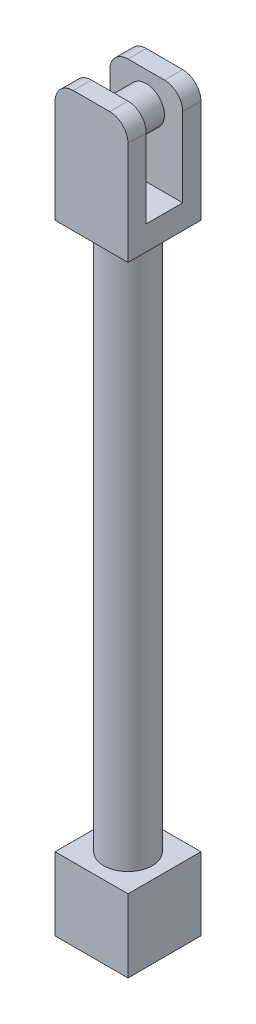
ISO-10303-21;
HEADER;
FILE_DESCRIPTION(('STEP AP214'),'2;1');
FILE_NAME('part.step','',(''),(''),'','','');
FILE_SCHEMA(('AUTOMOTIVE_DESIGN { 1 0 10303 214 1 1 1 1 }'));
ENDSEC;
DATA;
#1=APPLICATION_CONTEXT('core data for automotive mechanical design processes');
#2=APPLICATION_PROTOCOL_DEFINITION('international standard','automotive_design',2000,#1);
#3=PRODUCT_CONTEXT('',#1,'mechanical');
#4=PRODUCT('Part','Part','',(#3));
#5=PRODUCT_RELATED_PRODUCT_CATEGORY('part','',(#4));
#6=PRODUCT_DEFINITION_FORMATION('','',#4);
#7=PRODUCT_DEFINITION_CONTEXT('part definition',#1,'design');
#8=PRODUCT_DEFINITION('design','',#6,#7);
#9=PRODUCT_DEFINITION_SHAPE('','',#8);
#10=(LENGTH_UNIT() NAMED_UNIT(*) SI_UNIT(.MILLI.,.METRE.));
#11=(NAMED_UNIT(*) PLANE_ANGLE_UNIT() SI_UNIT($,.RADIAN.));
#12=(NAMED_UNIT(*) SI_UNIT($,.STERADIAN.) SOLID_ANGLE_UNIT());
#13=UNCERTAINTY_MEASURE_WITH_UNIT(LENGTH_MEASURE(1.E-05),#10,'distance_accuracy_value','');
#14=(GEOMETRIC_REPRESENTATION_CONTEXT(3) GLOBAL_UNCERTAINTY_ASSIGNED_CONTEXT((#13)) GLOBAL_UNIT_ASSIGNED_CONTEXT((#10,
#11,#12)) REPRESENTATION_CONTEXT('',''));
#15=CARTESIAN_POINT('',(0.,0.,0.));
#16=DIRECTION('',(0.,0.,1.));
#17=DIRECTION('',(1.,0.,0.));
#18=AXIS2_PLACEMENT_3D('',#15,#16,#17);
#19=CARTESIAN_POINT('',(0.,305.,0.));
#20=DIRECTION('',(0.,1.,0.));
#21=DIRECTION('',(0.,0.,1.));
#22=AXIS2_PLACEMENT_3D('',#19,#20,#21);
#23=PLANE('',#22);
#24=DIRECTION('',(-1.,0.,0.));
#25=VECTOR('',#24,1.);
#26=CARTESIAN_POINT('',(-15.,305.,-7.5));
#27=LINE('',#26,#25);
#28=CARTESIAN_POINT('',(7.5,305.,-7.5));
#29=VERTEX_POINT('',#28);
#30=CARTESIAN_POINT('',(-7.5,305.,-7.5));
#31=VERTEX_POINT('',#30);
#32=EDGE_CURVE('E172',#29,#31,#27,.T.);
#33=ORIENTED_EDGE('',*,*,#32,.F.);
#34=DIRECTION('',(0.,0.,-1.));
#35=VECTOR('',#34,1.);
#36=CARTESIAN_POINT('',(7.5,305.,-15.));
#37=LINE('',#36,#35);
#38=CARTESIAN_POINT('',(7.5,305.,-15.));
#39=VERTEX_POINT('',#38);
#40=EDGE_CURVE('E283',#29,#39,#37,.T.);
#41=ORIENTED_EDGE('',*,*,#40,.T.);
#42=DIRECTION('',(-1.,0.,0.));
#43=VECTOR('',#42,1.);
#44=CARTESIAN_POINT('',(-15.,305.,-15.));
#45=LINE('',#44,#43);
#46=CARTESIAN_POINT('',(-7.5,305.,-15.));
#47=VERTEX_POINT('',#46);
#48=EDGE_CURVE('E184',#39,#47,#45,.T.);
#49=ORIENTED_EDGE('',*,*,#48,.T.);
#50=DIRECTION('',(0.,0.,1.));
#51=VECTOR('',#50,1.);
#52=CARTESIAN_POINT('',(-7.5,305.,-7.5));
#53=LINE('',#52,#51);
#54=EDGE_CURVE('E279',#47,#31,#53,.T.);
#55=ORIENTED_EDGE('',*,*,#54,.T.);
#56=EDGE_LOOP('',(#33,#41,#49,#55));
#57=FACE_BOUND('',#56,.T.);
#58=ADVANCED_FACE('F39',(#57),#23,.T.);
#59=CARTESIAN_POINT('',(15.,30.,-15.));
#60=DIRECTION('',(-1.,0.,0.));
#61=DIRECTION('',(0.,0.,1.));
#62=AXIS2_PLACEMENT_3D('',#59,#60,#61);
#63=PLANE('',#62);
#64=DIRECTION('',(0.,0.,-1.));
#65=VECTOR('',#64,1.);
#66=CARTESIAN_POINT('',(15.,0.,-15.));
#67=LINE('',#66,#65);
#68=CARTESIAN_POINT('',(15.,0.,15.));
#69=VERTEX_POINT('',#68);
#70=CARTESIAN_POINT('',(15.,0.,-15.));
#71=VERTEX_POINT('',#70);
#72=EDGE_CURVE('E225',#69,#71,#67,.T.);
#73=ORIENTED_EDGE('',*,*,#72,.T.);
#74=DIRECTION('',(0.,-1.,0.));
#75=VECTOR('',#74,1.);
#76=CARTESIAN_POINT('',(15.,30.,-15.));
#77=LINE('',#76,#75);
#78=CARTESIAN_POINT('',(15.,30.,-15.));
#79=VERTEX_POINT('',#78);
#80=EDGE_CURVE('E231',#79,#71,#77,.T.);
#81=ORIENTED_EDGE('',*,*,#80,.F.);
#82=DIRECTION('',(0.,0.,-1.));
#83=VECTOR('',#82,1.);
#84=CARTESIAN_POINT('',(15.,30.,-15.));
#85=LINE('',#84,#83);
#86=CARTESIAN_POINT('',(15.,30.,15.));
#87=VERTEX_POINT('',#86);
#88=EDGE_CURVE('E232',#87,#79,#85,.T.);
#89=ORIENTED_EDGE('',*,*,#88,.F.);
#90=DIRECTION('',(0.,-1.,0.));
#91=VECTOR('',#90,1.);
#92=CARTESIAN_POINT('',(15.,30.,15.));
#93=LINE('',#92,#91);
#94=EDGE_CURVE('E246',#87,#69,#93,.T.);
#95=ORIENTED_EDGE('',*,*,#94,.T.);
#96=EDGE_LOOP('',(#73,#81,#89,#95));
#97=FACE_BOUND('',#96,.T.);
#98=ADVANCED_FACE('F386',(#97),#63,.F.);
#99=CARTESIAN_POINT('',(-15.,30.,-15.));
#100=DIRECTION('',(0.,0.,1.));
#101=DIRECTION('',(1.,0.,0.));
#102=AXIS2_PLACEMENT_3D('',#99,#100,#101);
#103=PLANE('',#102);
#104=DIRECTION('',(-1.,0.,0.));
#105=VECTOR('',#104,1.);
#106=CARTESIAN_POINT('',(-15.,0.,-15.));
#107=LINE('',#106,#105);
#108=CARTESIAN_POINT('',(-15.,0.,-15.));
#109=VERTEX_POINT('',#108);
#110=EDGE_CURVE('E250',#71,#109,#107,.T.);
#111=ORIENTED_EDGE('',*,*,#110,.T.);
#112=DIRECTION('',(0.,-1.,0.));
#113=VECTOR('',#112,1.);
#114=CARTESIAN_POINT('',(-15.,30.,-15.));
#115=LINE('',#114,#113);
#116=CARTESIAN_POINT('',(-15.,30.,-15.));
#117=VERTEX_POINT('',#116);
#118=EDGE_CURVE('E265',#117,#109,#115,.T.);
#119=ORIENTED_EDGE('',*,*,#118,.F.);
#120=DIRECTION('',(-1.,0.,0.));
#121=VECTOR('',#120,1.);
#122=CARTESIAN_POINT('',(-15.,30.,-15.));
#123=LINE('',#122,#121);
#124=EDGE_CURVE('E236',#79,#117,#123,.T.);
#125=ORIENTED_EDGE('',*,*,#124,.F.);
#126=ORIENTED_EDGE('',*,*,#80,.T.);
#127=EDGE_LOOP('',(#111,#119,#125,#126));
#128=FACE_BOUND('',#127,.T.);
#129=ADVANCED_FACE('F390',(#128),#103,.F.);
#130=CARTESIAN_POINT('',(-15.,30.,-15.));
#131=DIRECTION('',(1.,0.,0.));
#132=DIRECTION('',(0.,0.,-1.));
#133=AXIS2_PLACEMENT_3D('',#130,#131,#132);
#134=PLANE('',#133);
#135=DIRECTION('',(0.,0.,1.));
#136=VECTOR('',#135,1.);
#137=CARTESIAN_POINT('',(-15.,0.,-15.));
#138=LINE('',#137,#136);
#139=CARTESIAN_POINT('',(-15.,0.,15.));
#140=VERTEX_POINT('',#139);
#141=EDGE_CURVE('E253',#109,#140,#138,.T.);
#142=ORIENTED_EDGE('',*,*,#141,.T.);
#143=DIRECTION('',(0.,-1.,0.));
#144=VECTOR('',#143,1.);
#145=CARTESIAN_POINT('',(-15.,30.,15.));
#146=LINE('',#145,#144);
#147=CARTESIAN_POINT('',(-15.,30.,15.));
#148=VERTEX_POINT('',#147);
#149=EDGE_CURVE('E261',#148,#140,#146,.T.);
#150=ORIENTED_EDGE('',*,*,#149,.F.);
#151=DIRECTION('',(0.,0.,1.));
#152=VECTOR('',#151,1.);
#153=CARTESIAN_POINT('',(-15.,30.,-15.));
#154=LINE('',#153,#152);
#155=EDGE_CURVE('E240',#117,#148,#154,.T.);
#156=ORIENTED_EDGE('',*,*,#155,.F.);
#157=ORIENTED_EDGE('',*,*,#118,.T.);
#158=EDGE_LOOP('',(#142,#150,#156,#157));
#159=FACE_BOUND('',#158,.T.);
#160=ADVANCED_FACE('F426',(#159),#134,.F.);
#161=CARTESIAN_POINT('',(-15.,30.,15.));
#162=DIRECTION('',(0.,0.,-1.));
#163=DIRECTION('',(-1.,0.,0.));
#164=AXIS2_PLACEMENT_3D('',#161,#162,#163);
#165=PLANE('',#164);
#166=DIRECTION('',(1.,0.,0.));
#167=VECTOR('',#166,1.);
#168=CARTESIAN_POINT('',(-15.,0.,15.));
#169=LINE('',#168,#167);
#170=EDGE_CURVE('E237',#140,#69,#169,.T.);
#171=ORIENTED_EDGE('',*,*,#170,.T.);
#172=ORIENTED_EDGE('',*,*,#94,.F.);
#173=DIRECTION('',(1.,0.,0.));
#174=VECTOR('',#173,1.);
#175=CARTESIAN_POINT('',(-15.,30.,15.));
#176=LINE('',#175,#174);
#177=EDGE_CURVE('E243',#148,#87,#176,.T.);
#178=ORIENTED_EDGE('',*,*,#177,.F.);
#179=ORIENTED_EDGE('',*,*,#149,.T.);
#180=EDGE_LOOP('',(#171,#172,#178,#179));
#181=FACE_BOUND('',#180,.T.);
#182=ADVANCED_FACE('F413',(#181),#165,.F.);
#183=CARTESIAN_POINT('',(0.,30.,0.));
#184=DIRECTION('',(0.,1.,0.));
#185=DIRECTION('',(0.,0.,1.));
#186=AXIS2_PLACEMENT_3D('',#183,#184,#185);
#187=PLANE('',#186);
#188=CARTESIAN_POINT('',(0.,30.,0.));
#189=DIRECTION('',(0.,1.,0.));
#190=DIRECTION('',(0.,0.,1.));
#191=AXIS2_PLACEMENT_3D('',#188,#189,#190);
#192=CIRCLE('',#191,10.);
#193=CARTESIAN_POINT('',(0.,30.,10.));
#194=VERTEX_POINT('',#193);
#195=EDGE_CURVE('E226',#194,#194,#192,.T.);
#196=ORIENTED_EDGE('',*,*,#195,.F.);
#197=EDGE_LOOP('',(#196));
#198=FACE_BOUND('',#197,.T.);
#199=ORIENTED_EDGE('',*,*,#88,.T.);
#200=ORIENTED_EDGE('',*,*,#124,.T.);
#201=ORIENTED_EDGE('',*,*,#155,.T.);
#202=ORIENTED_EDGE('',*,*,#177,.T.);
#203=EDGE_LOOP('',(#199,#200,#201,#202));
#204=FACE_BOUND('',#203,.T.);
#205=ADVANCED_FACE('F410',(#198,#204),#187,.T.);
#206=CARTESIAN_POINT('',(0.,0.,0.));
#207=DIRECTION('',(0.,1.,0.));
#208=DIRECTION('',(0.,0.,1.));
#209=AXIS2_PLACEMENT_3D('',#206,#207,#208);
#210=PLANE('',#209);
#211=ORIENTED_EDGE('',*,*,#72,.F.);
#212=ORIENTED_EDGE('',*,*,#170,.F.);
#213=ORIENTED_EDGE('',*,*,#141,.F.);
#214=ORIENTED_EDGE('',*,*,#110,.F.);
#215=EDGE_LOOP('',(#211,#212,#213,#214));
#216=FACE_BOUND('',#215,.T.);
#217=ADVANCED_FACE('F406',(#216),#210,.F.);
#218=CARTESIAN_POINT('',(0.,255.,0.));
#219=DIRECTION('',(0.,-1.,0.));
#220=DIRECTION('',(0.,0.,-1.));
#221=AXIS2_PLACEMENT_3D('',#218,#219,#220);
#222=CYLINDRICAL_SURFACE('',#221,10.);
#223=CARTESIAN_POINT('',(0.,255.,0.));
#224=DIRECTION('',(0.,1.,0.));
#225=DIRECTION('',(0.,0.,1.));
#226=AXIS2_PLACEMENT_3D('',#223,#224,#225);
#227=CIRCLE('',#226,10.);
#228=CARTESIAN_POINT('',(0.,255.,10.));
#229=VERTEX_POINT('',#228);
#230=EDGE_CURVE('E221',#229,#229,#227,.T.);
#231=ORIENTED_EDGE('',*,*,#230,.F.);
#232=EDGE_LOOP('',(#231));
#233=FACE_BOUND('',#232,.T.);
#234=ORIENTED_EDGE('',*,*,#195,.T.);
#235=EDGE_LOOP('',(#234));
#236=FACE_BOUND('',#235,.T.);
#237=ADVANCED_FACE('F403',(#233,#236),#222,.T.);
#238=CARTESIAN_POINT('',(15.,305.,-15.));
#239=DIRECTION('',(-1.,0.,0.));
#240=DIRECTION('',(0.,0.,1.));
#241=AXIS2_PLACEMENT_3D('',#238,#239,#240);
#242=PLANE('',#241);
#243=DIRECTION('',(0.,-1.,0.));
#244=VECTOR('',#243,1.);
#245=CARTESIAN_POINT('',(15.,305.,-15.));
#246=LINE('',#245,#244);
#247=CARTESIAN_POINT('',(15.,297.5,-15.));
#248=VERTEX_POINT('',#247);
#249=CARTESIAN_POINT('',(15.,255.,-15.));
#250=VERTEX_POINT('',#249);
#251=EDGE_CURVE('E218',#248,#250,#246,.T.);
#252=ORIENTED_EDGE('',*,*,#251,.F.);
#253=DIRECTION('',(0.,0.,-1.));
#254=VECTOR('',#253,1.);
#255=CARTESIAN_POINT('',(15.,297.5,-7.5));
#256=LINE('',#255,#254);
#257=CARTESIAN_POINT('',(15.,297.5,-7.5));
#258=VERTEX_POINT('',#257);
#259=EDGE_CURVE('E296',#248,#258,#256,.F.);
#260=ORIENTED_EDGE('',*,*,#259,.T.);
#261=DIRECTION('',(0.,1.,0.));
#262=VECTOR('',#261,1.);
#263=CARTESIAN_POINT('',(15.,265.,-7.5));
#264=LINE('',#263,#262);
#265=CARTESIAN_POINT('',(15.,265.,-7.5));
#266=VERTEX_POINT('',#265);
#267=EDGE_CURVE('E179',#266,#258,#264,.T.);
#268=ORIENTED_EDGE('',*,*,#267,.F.);
#269=DIRECTION('',(0.,0.,-1.));
#270=VECTOR('',#269,1.);
#271=CARTESIAN_POINT('',(15.,265.,-7.5));
#272=LINE('',#271,#270);
#273=CARTESIAN_POINT('',(15.,265.,7.5));
#274=VERTEX_POINT('',#273);
#275=EDGE_CURVE('E162',#274,#266,#272,.T.);
#276=ORIENTED_EDGE('',*,*,#275,.F.);
#277=DIRECTION('',(0.,1.,0.));
#278=VECTOR('',#277,1.);
#279=CARTESIAN_POINT('',(15.,265.,7.5));
#280=LINE('',#279,#278);
#281=CARTESIAN_POINT('',(15.,297.5,7.5));
#282=VERTEX_POINT('',#281);
#283=EDGE_CURVE('E158',#274,#282,#280,.T.);
#284=ORIENTED_EDGE('',*,*,#283,.T.);
#285=DIRECTION('',(0.,0.,-1.));
#286=VECTOR('',#285,1.);
#287=CARTESIAN_POINT('',(15.,297.5,15.));
#288=LINE('',#287,#286);
#289=CARTESIAN_POINT('',(15.,297.5,15.));
#290=VERTEX_POINT('',#289);
#291=EDGE_CURVE('E293',#282,#290,#288,.F.);
#292=ORIENTED_EDGE('',*,*,#291,.T.);
#293=DIRECTION('',(0.,-1.,0.));
#294=VECTOR('',#293,1.);
#295=CARTESIAN_POINT('',(15.,305.,15.));
#296=LINE('',#295,#294);
#297=CARTESIAN_POINT('',(15.,255.,15.));
#298=VERTEX_POINT('',#297);
#299=EDGE_CURVE('E193',#290,#298,#296,.T.);
#300=ORIENTED_EDGE('',*,*,#299,.T.);
#301=DIRECTION('',(0.,0.,-1.));
#302=VECTOR('',#301,1.);
#303=CARTESIAN_POINT('',(15.,255.,-15.));
#304=LINE('',#303,#302);
#305=EDGE_CURVE('E194',#298,#250,#304,.T.);
#306=ORIENTED_EDGE('',*,*,#305,.T.);
#307=EDGE_LOOP('',(#252,#260,#268,#276,#284,#292,#300,#306));
#308=FACE_BOUND('',#307,.T.);
#309=ADVANCED_FACE('F356',(#308),#242,.F.);
#310=CARTESIAN_POINT('',(-15.,305.,-15.));
#311=DIRECTION('',(0.,0.,1.));
#312=DIRECTION('',(1.,0.,0.));
#313=AXIS2_PLACEMENT_3D('',#310,#311,#312);
#314=PLANE('',#313);
#315=ORIENTED_EDGE('',*,*,#48,.F.);
#316=CARTESIAN_POINT('',(7.5,297.5,-15.));
#317=DIRECTION('',(0.,0.,1.));
#318=DIRECTION('',(1.,0.,0.));
#319=AXIS2_PLACEMENT_3D('',#316,#317,#318);
#320=CIRCLE('',#319,7.5);
#321=EDGE_CURVE('E290',#39,#248,#320,.F.);
#322=ORIENTED_EDGE('',*,*,#321,.T.);
#323=ORIENTED_EDGE('',*,*,#251,.T.);
#324=DIRECTION('',(-1.,0.,0.));
#325=VECTOR('',#324,1.);
#326=CARTESIAN_POINT('',(-15.,255.,-15.));
#327=LINE('',#326,#325);
#328=CARTESIAN_POINT('',(-15.,255.,-15.));
#329=VERTEX_POINT('',#328);
#330=EDGE_CURVE('E198',#250,#329,#327,.T.);
#331=ORIENTED_EDGE('',*,*,#330,.T.);
#332=DIRECTION('',(0.,-1.,0.));
#333=VECTOR('',#332,1.);
#334=CARTESIAN_POINT('',(-15.,305.,-15.));
#335=LINE('',#334,#333);
#336=CARTESIAN_POINT('',(-15.,297.5,-15.));
#337=VERTEX_POINT('',#336);
#338=EDGE_CURVE('E215',#337,#329,#335,.T.);
#339=ORIENTED_EDGE('',*,*,#338,.F.);
#340=CARTESIAN_POINT('',(-7.5,297.5,-15.));
#341=DIRECTION('',(0.,0.,1.));
#342=DIRECTION('',(1.,0.,0.));
#343=AXIS2_PLACEMENT_3D('',#340,#341,#342);
#344=CIRCLE('',#343,7.5);
#345=EDGE_CURVE('E287',#337,#47,#344,.F.);
#346=ORIENTED_EDGE('',*,*,#345,.T.);
#347=EDGE_LOOP('',(#315,#322,#323,#331,#339,#346));
#348=FACE_BOUND('',#347,.T.);
#349=ADVANCED_FACE('F330',(#348),#314,.F.);
#350=CARTESIAN_POINT('',(-15.,305.,-15.));
#351=DIRECTION('',(1.,0.,0.));
#352=DIRECTION('',(0.,0.,-1.));
#353=AXIS2_PLACEMENT_3D('',#350,#351,#352);
#354=PLANE('',#353);
#355=DIRECTION('',(0.,-1.,0.));
#356=VECTOR('',#355,1.);
#357=CARTESIAN_POINT('',(-15.,305.,15.));
#358=LINE('',#357,#356);
#359=CARTESIAN_POINT('',(-15.,297.5,15.));
#360=VERTEX_POINT('',#359);
#361=CARTESIAN_POINT('',(-15.,255.,15.));
#362=VERTEX_POINT('',#361);
#363=EDGE_CURVE('E212',#360,#362,#358,.T.);
#364=ORIENTED_EDGE('',*,*,#363,.F.);
#365=DIRECTION('',(0.,0.,1.));
#366=VECTOR('',#365,1.);
#367=CARTESIAN_POINT('',(-15.,297.5,7.5));
#368=LINE('',#367,#366);
#369=CARTESIAN_POINT('',(-15.,297.5,7.5));
#370=VERTEX_POINT('',#369);
#371=EDGE_CURVE('E11',#360,#370,#368,.F.);
#372=ORIENTED_EDGE('',*,*,#371,.T.);
#373=DIRECTION('',(0.,1.,0.));
#374=VECTOR('',#373,1.);
#375=CARTESIAN_POINT('',(-15.,265.,7.5));
#376=LINE('',#375,#374);
#377=CARTESIAN_POINT('',(-15.,265.,7.5));
#378=VERTEX_POINT('',#377);
#379=EDGE_CURVE('E155',#378,#370,#376,.T.);
#380=ORIENTED_EDGE('',*,*,#379,.F.);
#381=DIRECTION('',(0.,0.,1.));
#382=VECTOR('',#381,1.);
#383=CARTESIAN_POINT('',(-15.,265.,-7.5));
#384=LINE('',#383,#382);
#385=CARTESIAN_POINT('',(-15.,265.,-7.5));
#386=VERTEX_POINT('',#385);
#387=EDGE_CURVE('E163',#386,#378,#384,.T.);
#388=ORIENTED_EDGE('',*,*,#387,.F.);
#389=DIRECTION('',(0.,1.,0.));
#390=VECTOR('',#389,1.);
#391=CARTESIAN_POINT('',(-15.,265.,-7.5));
#392=LINE('',#391,#390);
#393=CARTESIAN_POINT('',(-15.,297.5,-7.5));
#394=VERTEX_POINT('',#393);
#395=EDGE_CURVE('E199',#386,#394,#392,.T.);
#396=ORIENTED_EDGE('',*,*,#395,.T.);
#397=DIRECTION('',(0.,0.,1.));
#398=VECTOR('',#397,1.);
#399=CARTESIAN_POINT('',(-15.,297.5,-15.));
#400=LINE('',#399,#398);
#401=EDGE_CURVE('E48',#394,#337,#400,.F.);
#402=ORIENTED_EDGE('',*,*,#401,.T.);
#403=ORIENTED_EDGE('',*,*,#338,.T.);
#404=DIRECTION('',(0.,0.,1.));
#405=VECTOR('',#404,1.);
#406=CARTESIAN_POINT('',(-15.,255.,-15.));
#407=LINE('',#406,#405);
#408=EDGE_CURVE('E203',#329,#362,#407,.T.);
#409=ORIENTED_EDGE('',*,*,#408,.T.);
#410=EDGE_LOOP('',(#364,#372,#380,#388,#396,#402,#403,#409));
#411=FACE_BOUND('',#410,.T.);
#412=ADVANCED_FACE('F174',(#411),#354,.F.);
#413=CARTESIAN_POINT('',(-15.,305.,15.));
#414=DIRECTION('',(0.,0.,-1.));
#415=DIRECTION('',(-1.,0.,0.));
#416=AXIS2_PLACEMENT_3D('',#413,#414,#415);
#417=PLANE('',#416);
#418=ORIENTED_EDGE('',*,*,#299,.F.);
#419=CARTESIAN_POINT('',(7.5,297.5,15.));
#420=DIRECTION('',(0.,0.,-1.));
#421=DIRECTION('',(-1.,0.,0.));
#422=AXIS2_PLACEMENT_3D('',#419,#420,#421);
#423=CIRCLE('',#422,7.5);
#424=CARTESIAN_POINT('',(7.5,305.,15.));
#425=VERTEX_POINT('',#424);
#426=EDGE_CURVE('E321',#290,#425,#423,.F.);
#427=ORIENTED_EDGE('',*,*,#426,.T.);
#428=DIRECTION('',(1.,0.,0.));
#429=VECTOR('',#428,1.);
#430=CARTESIAN_POINT('',(-15.,305.,15.));
#431=LINE('',#430,#429);
#432=CARTESIAN_POINT('',(-7.5,305.,15.));
#433=VERTEX_POINT('',#432);
#434=EDGE_CURVE('E188',#433,#425,#431,.T.);
#435=ORIENTED_EDGE('',*,*,#434,.F.);
#436=CARTESIAN_POINT('',(-7.5,297.5,15.));
#437=DIRECTION('',(0.,0.,-1.));
#438=DIRECTION('',(-1.,0.,0.));
#439=AXIS2_PLACEMENT_3D('',#436,#437,#438);
#440=CIRCLE('',#439,7.5);
#441=EDGE_CURVE('E55',#433,#360,#440,.F.);
#442=ORIENTED_EDGE('',*,*,#441,.T.);
#443=ORIENTED_EDGE('',*,*,#363,.T.);
#444=DIRECTION('',(1.,0.,0.));
#445=VECTOR('',#444,1.);
#446=CARTESIAN_POINT('',(-15.,255.,15.));
#447=LINE('',#446,#445);
#448=EDGE_CURVE('E189',#362,#298,#447,.T.);
#449=ORIENTED_EDGE('',*,*,#448,.T.);
#450=EDGE_LOOP('',(#418,#427,#435,#442,#443,#449));
#451=FACE_BOUND('',#450,.T.);
#452=ADVANCED_FACE('F375',(#451),#417,.F.);
#453=ORIENTED_EDGE('',*,*,#434,.T.);
#454=DIRECTION('',(0.,0.,-1.));
#455=VECTOR('',#454,1.);
#456=CARTESIAN_POINT('',(7.5,305.,7.5));
#457=LINE('',#456,#455);
#458=CARTESIAN_POINT('',(7.5,305.,7.5));
#459=VERTEX_POINT('',#458);
#460=EDGE_CURVE('E309',#425,#459,#457,.T.);
#461=ORIENTED_EDGE('',*,*,#460,.T.);
#462=DIRECTION('',(1.,0.,0.));
#463=VECTOR('',#462,1.);
#464=CARTESIAN_POINT('',(-15.,305.,7.5));
#465=LINE('',#464,#463);
#466=CARTESIAN_POINT('',(-7.5,305.,7.5));
#467=VERTEX_POINT('',#466);
#468=EDGE_CURVE('E343',#467,#459,#465,.T.);
#469=ORIENTED_EDGE('',*,*,#468,.F.);
#470=DIRECTION('',(0.,0.,1.));
#471=VECTOR('',#470,1.);
#472=CARTESIAN_POINT('',(-7.5,305.,15.));
#473=LINE('',#472,#471);
#474=EDGE_CURVE('E305',#467,#433,#473,.T.);
#475=ORIENTED_EDGE('',*,*,#474,.T.);
#476=EDGE_LOOP('',(#453,#461,#469,#475));
#477=FACE_BOUND('',#476,.T.);
#478=ADVANCED_FACE('F367',(#477),#23,.T.);
#479=CARTESIAN_POINT('',(0.,255.,0.));
#480=DIRECTION('',(0.,1.,0.));
#481=DIRECTION('',(0.,0.,1.));
#482=AXIS2_PLACEMENT_3D('',#479,#480,#481);
#483=PLANE('',#482);
#484=ORIENTED_EDGE('',*,*,#230,.T.);
#485=EDGE_LOOP('',(#484));
#486=FACE_BOUND('',#485,.T.);
#487=ORIENTED_EDGE('',*,*,#305,.F.);
#488=ORIENTED_EDGE('',*,*,#448,.F.);
#489=ORIENTED_EDGE('',*,*,#408,.F.);
#490=ORIENTED_EDGE('',*,*,#330,.F.);
#491=EDGE_LOOP('',(#487,#488,#489,#490));
#492=FACE_BOUND('',#491,.T.);
#493=ADVANCED_FACE('F361',(#486,#492),#483,.F.);
#494=CARTESIAN_POINT('',(-15.,265.,-7.5));
#495=DIRECTION('',(0.,0.,-1.));
#496=DIRECTION('',(-1.,0.,0.));
#497=AXIS2_PLACEMENT_3D('',#494,#495,#496);
#498=PLANE('',#497);
#499=CARTESIAN_POINT('',(0.,292.5,-7.5));
#500=DIRECTION('',(0.,0.,-1.));
#501=DIRECTION('',(-1.,0.,0.));
#502=AXIS2_PLACEMENT_3D('',#499,#500,#501);
#503=CIRCLE('',#502,7.50000000000001);
#504=CARTESIAN_POINT('',(-7.50000000000001,292.5,-7.5));
#505=VERTEX_POINT('',#504);
#506=EDGE_CURVE('E275',#505,#505,#503,.F.);
#507=ORIENTED_EDGE('',*,*,#506,.F.);
#508=EDGE_LOOP('',(#507));
#509=FACE_BOUND('',#508,.T.);
#510=ORIENTED_EDGE('',*,*,#267,.T.);
#511=CARTESIAN_POINT('',(7.5,297.5,-7.5));
#512=DIRECTION('',(0.,0.,-1.));
#513=DIRECTION('',(-1.,0.,0.));
#514=AXIS2_PLACEMENT_3D('',#511,#512,#513);
#515=CIRCLE('',#514,7.5);
#516=EDGE_CURVE('E302',#258,#29,#515,.F.);
#517=ORIENTED_EDGE('',*,*,#516,.T.);
#518=ORIENTED_EDGE('',*,*,#32,.T.);
#519=CARTESIAN_POINT('',(-7.5,297.5,-7.5));
#520=DIRECTION('',(0.,0.,-1.));
#521=DIRECTION('',(-1.,0.,0.));
#522=AXIS2_PLACEMENT_3D('',#519,#520,#521);
#523=CIRCLE('',#522,7.5);
#524=EDGE_CURVE('E299',#31,#394,#523,.F.);
#525=ORIENTED_EDGE('',*,*,#524,.T.);
#526=ORIENTED_EDGE('',*,*,#395,.F.);
#527=DIRECTION('',(-1.,0.,0.));
#528=VECTOR('',#527,1.);
#529=CARTESIAN_POINT('',(-15.,265.,-7.5));
#530=LINE('',#529,#528);
#531=EDGE_CURVE('E169',#266,#386,#530,.T.);
#532=ORIENTED_EDGE('',*,*,#531,.F.);
#533=EDGE_LOOP('',(#510,#517,#518,#525,#526,#532));
#534=FACE_BOUND('',#533,.T.);
#535=ADVANCED_FACE('F340',(#509,#534),#498,.F.);
#536=CARTESIAN_POINT('',(-15.,265.,7.5));
#537=DIRECTION('',(0.,0.,1.));
#538=DIRECTION('',(1.,0.,0.));
#539=AXIS2_PLACEMENT_3D('',#536,#537,#538);
#540=PLANE('',#539);
#541=CARTESIAN_POINT('',(0.,292.5,7.5));
#542=DIRECTION('',(0.,0.,1.));
#543=DIRECTION('',(1.,0.,0.));
#544=AXIS2_PLACEMENT_3D('',#541,#542,#543);
#545=CIRCLE('',#544,7.50000000000001);
#546=CARTESIAN_POINT('',(7.50000000000001,292.5,7.5));
#547=VERTEX_POINT('',#546);
#548=EDGE_CURVE('E230',#547,#547,#545,.F.);
#549=ORIENTED_EDGE('',*,*,#548,.F.);
#550=EDGE_LOOP('',(#549));
#551=FACE_BOUND('',#550,.T.);
#552=ORIENTED_EDGE('',*,*,#468,.T.);
#553=CARTESIAN_POINT('',(7.5,297.5,7.5));
#554=DIRECTION('',(0.,0.,1.));
#555=DIRECTION('',(1.,0.,0.));
#556=AXIS2_PLACEMENT_3D('',#553,#554,#555);
#557=CIRCLE('',#556,7.5);
#558=EDGE_CURVE('E316',#459,#282,#557,.F.);
#559=ORIENTED_EDGE('',*,*,#558,.T.);
#560=ORIENTED_EDGE('',*,*,#283,.F.);
#561=DIRECTION('',(1.,0.,0.));
#562=VECTOR('',#561,1.);
#563=CARTESIAN_POINT('',(-15.,265.,7.5));
#564=LINE('',#563,#562);
#565=EDGE_CURVE('E151',#378,#274,#564,.T.);
#566=ORIENTED_EDGE('',*,*,#565,.F.);
#567=ORIENTED_EDGE('',*,*,#379,.T.);
#568=CARTESIAN_POINT('',(-7.5,297.5,7.5));
#569=DIRECTION('',(0.,0.,1.));
#570=DIRECTION('',(1.,0.,0.));
#571=AXIS2_PLACEMENT_3D('',#568,#569,#570);
#572=CIRCLE('',#571,7.5);
#573=EDGE_CURVE('E313',#370,#467,#572,.F.);
#574=ORIENTED_EDGE('',*,*,#573,.T.);
#575=EDGE_LOOP('',(#552,#559,#560,#566,#567,#574));
#576=FACE_BOUND('',#575,.T.);
#577=ADVANCED_FACE('F154',(#551,#576),#540,.F.);
#578=CARTESIAN_POINT('',(0.,265.,0.));
#579=DIRECTION('',(0.,1.,0.));
#580=DIRECTION('',(0.,0.,1.));
#581=AXIS2_PLACEMENT_3D('',#578,#579,#580);
#582=PLANE('',#581);
#583=ORIENTED_EDGE('',*,*,#387,.T.);
#584=ORIENTED_EDGE('',*,*,#565,.T.);
#585=ORIENTED_EDGE('',*,*,#275,.T.);
#586=ORIENTED_EDGE('',*,*,#531,.T.);
#587=EDGE_LOOP('',(#583,#584,#585,#586));
#588=FACE_BOUND('',#587,.T.);
#589=ADVANCED_FACE('F167',(#588),#582,.T.);
#590=CARTESIAN_POINT('',(0.,292.5,-28.7132034355965));
#591=DIRECTION('',(0.,0.,1.));
#592=DIRECTION('',(1.,0.,0.));
#593=AXIS2_PLACEMENT_3D('',#590,#591,#592);
#594=CYLINDRICAL_SURFACE('',#593,7.50000000000001);
#595=ORIENTED_EDGE('',*,*,#548,.T.);
#596=EDGE_LOOP('',(#595));
#597=FACE_BOUND('',#596,.T.);
#598=ORIENTED_EDGE('',*,*,#506,.T.);
#599=EDGE_LOOP('',(#598));
#600=FACE_BOUND('',#599,.T.);
#601=ADVANCED_FACE('F443',(#597,#600),#594,.T.);
#602=CARTESIAN_POINT('',(7.5,297.5,0.));
#603=DIRECTION('',(0.,0.,1.));
#604=DIRECTION('',(1.,0.,0.));
#605=AXIS2_PLACEMENT_3D('',#602,#603,#604);
#606=CYLINDRICAL_SURFACE('',#605,7.5);
#607=ORIENTED_EDGE('',*,*,#516,.F.);
#608=ORIENTED_EDGE('',*,*,#259,.F.);
#609=ORIENTED_EDGE('',*,*,#321,.F.);
#610=ORIENTED_EDGE('',*,*,#40,.F.);
#611=EDGE_LOOP('',(#607,#608,#609,#610));
#612=FACE_BOUND('',#611,.T.);
#613=ADVANCED_FACE('F354',(#612),#606,.T.);
#614=CARTESIAN_POINT('',(7.5,297.5,0.));
#615=DIRECTION('',(0.,0.,1.));
#616=DIRECTION('',(1.,0.,0.));
#617=AXIS2_PLACEMENT_3D('',#614,#615,#616);
#618=CYLINDRICAL_SURFACE('',#617,7.5);
#619=ORIENTED_EDGE('',*,*,#426,.F.);
#620=ORIENTED_EDGE('',*,*,#291,.F.);
#621=ORIENTED_EDGE('',*,*,#558,.F.);
#622=ORIENTED_EDGE('',*,*,#460,.F.);
#623=EDGE_LOOP('',(#619,#620,#621,#622));
#624=FACE_BOUND('',#623,.T.);
#625=ADVANCED_FACE('F371',(#624),#618,.T.);
#626=CARTESIAN_POINT('',(-7.5,297.5,0.));
#627=DIRECTION('',(0.,0.,-1.));
#628=DIRECTION('',(-1.,0.,0.));
#629=AXIS2_PLACEMENT_3D('',#626,#627,#628);
#630=CYLINDRICAL_SURFACE('',#629,7.5);
#631=ORIENTED_EDGE('',*,*,#573,.F.);
#632=ORIENTED_EDGE('',*,*,#371,.F.);
#633=ORIENTED_EDGE('',*,*,#441,.F.);
#634=ORIENTED_EDGE('',*,*,#474,.F.);
#635=EDGE_LOOP('',(#631,#632,#633,#634));
#636=FACE_BOUND('',#635,.T.);
#637=ADVANCED_FACE('F363',(#636),#630,.T.);
#638=CARTESIAN_POINT('',(-7.5,297.5,0.));
#639=DIRECTION('',(0.,0.,-1.));
#640=DIRECTION('',(-1.,0.,0.));
#641=AXIS2_PLACEMENT_3D('',#638,#639,#640);
#642=CYLINDRICAL_SURFACE('',#641,7.5);
#643=ORIENTED_EDGE('',*,*,#345,.F.);
#644=ORIENTED_EDGE('',*,*,#401,.F.);
#645=ORIENTED_EDGE('',*,*,#524,.F.);
#646=ORIENTED_EDGE('',*,*,#54,.F.);
#647=EDGE_LOOP('',(#643,#644,#645,#646));
#648=FACE_BOUND('',#647,.T.);
#649=ADVANCED_FACE('F41',(#648),#642,.T.);
#650=CLOSED_SHELL('',(#58,#98,#129,#160,#182,#205,#217,#237,#309,#349,#412,#452,#478,#493,#535,
#577,#589,#601,#613,#625,#637,#649));
#651=MANIFOLD_SOLID_BREP('B2',#650);
#652=ADVANCED_BREP_SHAPE_REPRESENTATION('',(#18,#651),#14);
#653=SHAPE_DEFINITION_REPRESENTATION(#9,#652);
ENDSEC;
END-ISO-10303-21;
